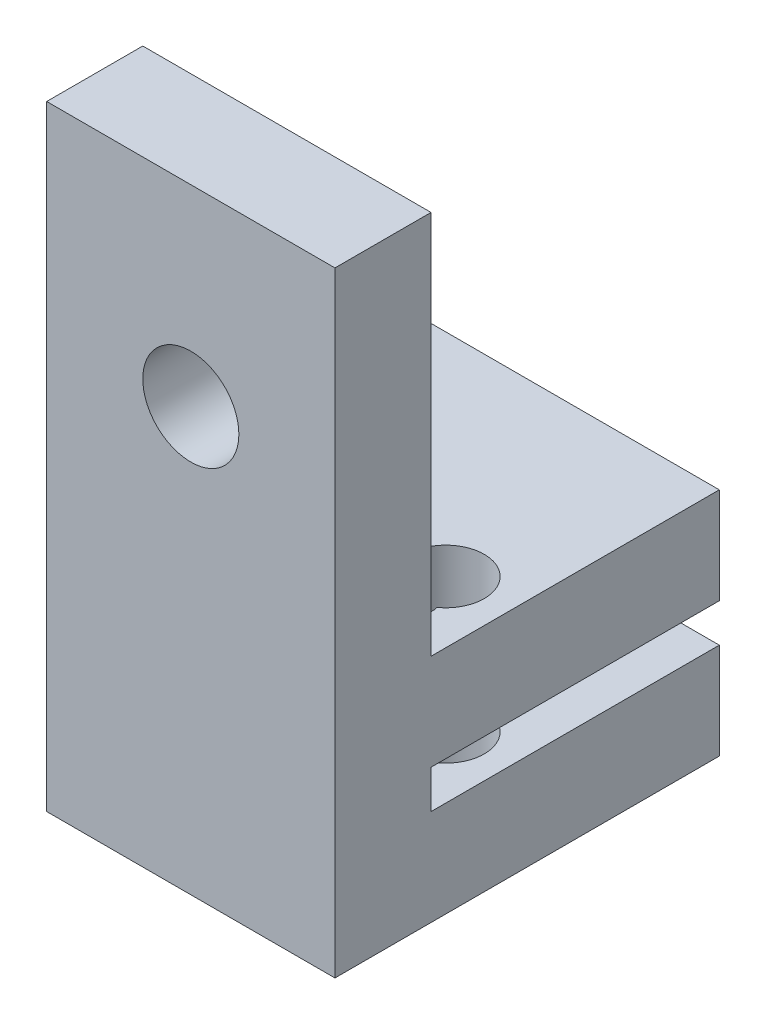
ISO-10303-21;
HEADER;
FILE_DESCRIPTION(('STEP AP214'),'2;1');
FILE_NAME('part.step','',(''),(''),'','','');
FILE_SCHEMA(('AUTOMOTIVE_DESIGN { 1 0 10303 214 1 1 1 1 }'));
ENDSEC;
DATA;
#1=APPLICATION_CONTEXT('core data for automotive mechanical design processes');
#2=APPLICATION_PROTOCOL_DEFINITION('international standard','automotive_design',2000,#1);
#3=PRODUCT_CONTEXT('',#1,'mechanical');
#4=PRODUCT('Part','Part','',(#3));
#5=PRODUCT_RELATED_PRODUCT_CATEGORY('part','',(#4));
#6=PRODUCT_DEFINITION_FORMATION('','',#4);
#7=PRODUCT_DEFINITION_CONTEXT('part definition',#1,'design');
#8=PRODUCT_DEFINITION('design','',#6,#7);
#9=PRODUCT_DEFINITION_SHAPE('','',#8);
#10=(LENGTH_UNIT() NAMED_UNIT(*) SI_UNIT(.MILLI.,.METRE.));
#11=(NAMED_UNIT(*) PLANE_ANGLE_UNIT() SI_UNIT($,.RADIAN.));
#12=(NAMED_UNIT(*) SI_UNIT($,.STERADIAN.) SOLID_ANGLE_UNIT());
#13=UNCERTAINTY_MEASURE_WITH_UNIT(LENGTH_MEASURE(1.E-05),#10,'distance_accuracy_value','');
#14=(GEOMETRIC_REPRESENTATION_CONTEXT(3) GLOBAL_UNCERTAINTY_ASSIGNED_CONTEXT((#13)) GLOBAL_UNIT_ASSIGNED_CONTEXT((#10,
#11,#12)) REPRESENTATION_CONTEXT('',''));
#15=CARTESIAN_POINT('',(0.,0.,0.));
#16=DIRECTION('',(0.,0.,1.));
#17=DIRECTION('',(1.,0.,0.));
#18=AXIS2_PLACEMENT_3D('',#15,#16,#17);
#19=CARTESIAN_POINT('',(15.,12.,0.));
#20=DIRECTION('',(0.,-1.,0.));
#21=DIRECTION('',(0.,0.,-1.));
#22=AXIS2_PLACEMENT_3D('',#19,#20,#21);
#23=PLANE('',#22);
#24=CARTESIAN_POINT('',(3.2115011604219,12.,11.0216006525548));
#25=DIRECTION('',(0.,-1.,0.));
#26=DIRECTION('',(0.,0.,-1.));
#27=AXIS2_PLACEMENT_3D('',#24,#25,#26);
#28=CIRCLE('',#27,2.);
#29=CARTESIAN_POINT('',(4.79508107290247,12.0000000000001,12.2431875961606));
#30=VERTEX_POINT('',#29);
#31=CARTESIAN_POINT('',(2.04272372503703,12.0000000000001,12.6445483739972));
#32=VERTEX_POINT('',#31);
#33=EDGE_CURVE('E178',#30,#32,#28,.F.);
#34=ORIENTED_EDGE('',*,*,#33,.F.);
#35=CARTESIAN_POINT('',(3.5,12.0000000000001,13.0000000000031));
#36=DIRECTION('',(0.,-1.,0.));
#37=DIRECTION('',(0.,0.,-1.));
#38=AXIS2_PLACEMENT_3D('',#35,#36,#37);
#39=CIRCLE('',#38,1.50000000000006);
#40=EDGE_CURVE('E56',#32,#30,#39,.F.);
#41=ORIENTED_EDGE('',*,*,#40,.F.);
#42=EDGE_LOOP('',(#34,#41));
#43=FACE_BOUND('',#42,.T.);
#44=CARTESIAN_POINT('',(11.7884988395781,12.,11.0216006525548));
#45=DIRECTION('',(0.,-1.,0.));
#46=DIRECTION('',(0.,0.,-1.));
#47=AXIS2_PLACEMENT_3D('',#44,#45,#46);
#48=CIRCLE('',#47,2.);
#49=CARTESIAN_POINT('',(12.957276274963,12.0000000000001,12.6445483739972));
#50=VERTEX_POINT('',#49);
#51=CARTESIAN_POINT('',(10.2049189270975,12.,12.2431875961606));
#52=VERTEX_POINT('',#51);
#53=EDGE_CURVE('E179',#50,#52,#48,.F.);
#54=ORIENTED_EDGE('',*,*,#53,.F.);
#55=CARTESIAN_POINT('',(11.5,12.0000000000001,13.0000000000031));
#56=DIRECTION('',(0.,-1.,0.));
#57=DIRECTION('',(0.,0.,-1.));
#58=AXIS2_PLACEMENT_3D('',#55,#56,#57);
#59=CIRCLE('',#58,1.50000000000006);
#60=EDGE_CURVE('E48',#52,#50,#59,.F.);
#61=ORIENTED_EDGE('',*,*,#60,.F.);
#62=EDGE_LOOP('',(#54,#61));
#63=FACE_BOUND('',#62,.T.);
#64=DIRECTION('',(-1.,0.,0.));
#65=VECTOR('',#64,1.);
#66=CARTESIAN_POINT('',(15.,12.0000000000001,15.0000000000112));
#67=LINE('',#66,#65);
#68=CARTESIAN_POINT('',(15.,12.0000000000001,15.0000000000112));
#69=VERTEX_POINT('',#68);
#70=CARTESIAN_POINT('',(0.,12.0000000000001,15.0000000000112));
#71=VERTEX_POINT('',#70);
#72=EDGE_CURVE('E200',#69,#71,#67,.T.);
#73=ORIENTED_EDGE('',*,*,#72,.F.);
#74=DIRECTION('',(0.,0.,1.));
#75=VECTOR('',#74,1.);
#76=CARTESIAN_POINT('',(15.,12.,0.));
#77=LINE('',#76,#75);
#78=CARTESIAN_POINT('',(15.,12.,0.));
#79=VERTEX_POINT('',#78);
#80=EDGE_CURVE('E241',#79,#69,#77,.T.);
#81=ORIENTED_EDGE('',*,*,#80,.F.);
#82=DIRECTION('',(-1.,0.,0.));
#83=VECTOR('',#82,1.);
#84=CARTESIAN_POINT('',(15.,12.,0.));
#85=LINE('',#84,#83);
#86=CARTESIAN_POINT('',(0.,12.,0.));
#87=VERTEX_POINT('',#86);
#88=EDGE_CURVE('E244',#79,#87,#85,.T.);
#89=ORIENTED_EDGE('',*,*,#88,.T.);
#90=DIRECTION('',(0.,0.,1.));
#91=VECTOR('',#90,1.);
#92=CARTESIAN_POINT('',(0.,12.,0.));
#93=LINE('',#92,#91);
#94=EDGE_CURVE('E229',#87,#71,#93,.T.);
#95=ORIENTED_EDGE('',*,*,#94,.T.);
#96=EDGE_LOOP('',(#73,#81,#89,#95));
#97=FACE_BOUND('',#96,.T.);
#98=ADVANCED_FACE('F33',(#43,#63,#97),#23,.F.);
#99=CARTESIAN_POINT('',(15.,-1.11022302462516E-13,20.0000000000031));
#100=DIRECTION('',(0.,0.,-1.));
#101=DIRECTION('',(-1.,0.,0.));
#102=AXIS2_PLACEMENT_3D('',#99,#100,#101);
#103=PLANE('',#102);
#104=DIRECTION('',(0.,-1.,0.));
#105=VECTOR('',#104,1.);
#106=CARTESIAN_POINT('',(0.,-1.11022302462516E-13,20.0000000000031));
#107=LINE('',#106,#105);
#108=CARTESIAN_POINT('',(0.,32.0000000000001,20.0000000000031));
#109=VERTEX_POINT('',#108);
#110=CARTESIAN_POINT('',(0.,-1.11022302462516E-13,20.0000000000031));
#111=VERTEX_POINT('',#110);
#112=EDGE_CURVE('E224',#109,#111,#107,.T.);
#113=ORIENTED_EDGE('',*,*,#112,.T.);
#114=DIRECTION('',(-1.,0.,0.));
#115=VECTOR('',#114,1.);
#116=CARTESIAN_POINT('',(15.,-1.11022302462516E-13,20.0000000000031));
#117=LINE('',#116,#115);
#118=CARTESIAN_POINT('',(15.,-1.11022302462516E-13,20.0000000000031));
#119=VERTEX_POINT('',#118);
#120=EDGE_CURVE('E169',#119,#111,#117,.T.);
#121=ORIENTED_EDGE('',*,*,#120,.F.);
#122=DIRECTION('',(0.,-1.,0.));
#123=VECTOR('',#122,1.);
#124=CARTESIAN_POINT('',(15.,-1.11022302462516E-13,20.0000000000031));
#125=LINE('',#124,#123);
#126=CARTESIAN_POINT('',(15.,32.0000000000001,20.0000000000031));
#127=VERTEX_POINT('',#126);
#128=EDGE_CURVE('E225',#127,#119,#125,.T.);
#129=ORIENTED_EDGE('',*,*,#128,.F.);
#130=DIRECTION('',(-1.,0.,0.));
#131=VECTOR('',#130,1.);
#132=CARTESIAN_POINT('',(15.,32.0000000000001,20.0000000000031));
#133=LINE('',#132,#131);
#134=EDGE_CURVE('E214',#127,#109,#133,.T.);
#135=ORIENTED_EDGE('',*,*,#134,.T.);
#136=EDGE_LOOP('',(#113,#121,#129,#135));
#137=FACE_BOUND('',#136,.T.);
#138=CARTESIAN_POINT('',(7.5,22.0000000000001,20.0000000000031));
#139=DIRECTION('',(0.,0.,1.));
#140=DIRECTION('',(1.,0.,0.));
#141=AXIS2_PLACEMENT_3D('',#138,#139,#140);
#142=CIRCLE('',#141,2.5);
#143=CARTESIAN_POINT('',(10.,22.0000000000001,20.0000000000031));
#144=VERTEX_POINT('',#143);
#145=EDGE_CURVE('E199',#144,#144,#142,.T.);
#146=ORIENTED_EDGE('',*,*,#145,.F.);
#147=EDGE_LOOP('',(#146));
#148=FACE_BOUND('',#147,.T.);
#149=ADVANCED_FACE('F35',(#137,#148),#103,.F.);
#150=CARTESIAN_POINT('',(15.,0.,0.));
#151=DIRECTION('',(0.,1.,0.));
#152=DIRECTION('',(0.,0.,1.));
#153=AXIS2_PLACEMENT_3D('',#150,#151,#152);
#154=PLANE('',#153);
#155=CARTESIAN_POINT('',(3.2115011604219,0.,11.0216006525548));
#156=DIRECTION('',(0.,-1.,0.));
#157=DIRECTION('',(0.,0.,-1.));
#158=AXIS2_PLACEMENT_3D('',#155,#156,#157);
#159=CIRCLE('',#158,2.);
#160=CARTESIAN_POINT('',(2.04272372503705,0.,12.6445483739972));
#161=VERTEX_POINT('',#160);
#162=CARTESIAN_POINT('',(4.79508107290245,0.,12.2431875961605));
#163=VERTEX_POINT('',#162);
#164=EDGE_CURVE('E175',#161,#163,#159,.T.);
#165=ORIENTED_EDGE('',*,*,#164,.F.);
#166=CARTESIAN_POINT('',(3.5,0.,13.0000000000031));
#167=DIRECTION('',(0.,-1.,0.));
#168=DIRECTION('',(0.,0.,-1.));
#169=AXIS2_PLACEMENT_3D('',#166,#167,#168);
#170=CIRCLE('',#169,1.50000000000006);
#171=EDGE_CURVE('E160',#163,#161,#170,.T.);
#172=ORIENTED_EDGE('',*,*,#171,.F.);
#173=EDGE_LOOP('',(#165,#172));
#174=FACE_BOUND('',#173,.T.);
#175=CARTESIAN_POINT('',(11.7884988395781,0.,11.0216006525548));
#176=DIRECTION('',(0.,-1.,0.));
#177=DIRECTION('',(0.,0.,-1.));
#178=AXIS2_PLACEMENT_3D('',#175,#176,#177);
#179=CIRCLE('',#178,2.);
#180=CARTESIAN_POINT('',(10.2049189270975,0.,12.2431875961605));
#181=VERTEX_POINT('',#180);
#182=CARTESIAN_POINT('',(12.957276274963,0.,12.6445483739972));
#183=VERTEX_POINT('',#182);
#184=EDGE_CURVE('E185',#181,#183,#179,.T.);
#185=ORIENTED_EDGE('',*,*,#184,.F.);
#186=CARTESIAN_POINT('',(11.5,0.,13.0000000000031));
#187=DIRECTION('',(0.,-1.,0.));
#188=DIRECTION('',(0.,0.,-1.));
#189=AXIS2_PLACEMENT_3D('',#186,#187,#188);
#190=CIRCLE('',#189,1.50000000000006);
#191=EDGE_CURVE('E545',#183,#181,#190,.T.);
#192=ORIENTED_EDGE('',*,*,#191,.F.);
#193=EDGE_LOOP('',(#185,#192));
#194=FACE_BOUND('',#193,.T.);
#195=DIRECTION('',(0.,0.,-1.));
#196=VECTOR('',#195,1.);
#197=CARTESIAN_POINT('',(0.,0.,0.));
#198=LINE('',#197,#196);
#199=CARTESIAN_POINT('',(0.,0.,0.));
#200=VERTEX_POINT('',#199);
#201=EDGE_CURVE('E247',#111,#200,#198,.T.);
#202=ORIENTED_EDGE('',*,*,#201,.T.);
#203=DIRECTION('',(-1.,0.,0.));
#204=VECTOR('',#203,1.);
#205=CARTESIAN_POINT('',(15.,0.,0.));
#206=LINE('',#205,#204);
#207=CARTESIAN_POINT('',(15.,0.,0.));
#208=VERTEX_POINT('',#207);
#209=EDGE_CURVE('E274',#208,#200,#206,.T.);
#210=ORIENTED_EDGE('',*,*,#209,.F.);
#211=DIRECTION('',(0.,0.,-1.));
#212=VECTOR('',#211,1.);
#213=CARTESIAN_POINT('',(15.,0.,0.));
#214=LINE('',#213,#212);
#215=EDGE_CURVE('E228',#119,#208,#214,.T.);
#216=ORIENTED_EDGE('',*,*,#215,.F.);
#217=ORIENTED_EDGE('',*,*,#120,.T.);
#218=EDGE_LOOP('',(#202,#210,#216,#217));
#219=FACE_BOUND('',#218,.T.);
#220=ADVANCED_FACE('F173',(#174,#194,#219),#154,.F.);
#221=CARTESIAN_POINT('',(15.,0.,0.));
#222=DIRECTION('',(0.,0.,1.));
#223=DIRECTION('',(1.,0.,0.));
#224=AXIS2_PLACEMENT_3D('',#221,#222,#223);
#225=PLANE('',#224);
#226=DIRECTION('',(0.,1.,0.));
#227=VECTOR('',#226,1.);
#228=CARTESIAN_POINT('',(0.,0.,0.));
#229=LINE('',#228,#227);
#230=CARTESIAN_POINT('',(0.,5.,0.));
#231=VERTEX_POINT('',#230);
#232=EDGE_CURVE('E249',#200,#231,#229,.T.);
#233=ORIENTED_EDGE('',*,*,#232,.T.);
#234=DIRECTION('',(-1.,0.,0.));
#235=VECTOR('',#234,1.);
#236=CARTESIAN_POINT('',(15.,5.,0.));
#237=LINE('',#236,#235);
#238=CARTESIAN_POINT('',(15.,5.,0.));
#239=VERTEX_POINT('',#238);
#240=EDGE_CURVE('E271',#239,#231,#237,.T.);
#241=ORIENTED_EDGE('',*,*,#240,.F.);
#242=DIRECTION('',(0.,1.,0.));
#243=VECTOR('',#242,1.);
#244=CARTESIAN_POINT('',(15.,0.,0.));
#245=LINE('',#244,#243);
#246=EDGE_CURVE('E231',#208,#239,#245,.T.);
#247=ORIENTED_EDGE('',*,*,#246,.F.);
#248=ORIENTED_EDGE('',*,*,#209,.T.);
#249=EDGE_LOOP('',(#233,#241,#247,#248));
#250=FACE_BOUND('',#249,.T.);
#251=ADVANCED_FACE('F354',(#250),#225,.F.);
#252=CARTESIAN_POINT('',(15.,5.,0.));
#253=DIRECTION('',(0.,-1.,0.));
#254=DIRECTION('',(0.,0.,-1.));
#255=AXIS2_PLACEMENT_3D('',#252,#253,#254);
#256=PLANE('',#255);
#257=CARTESIAN_POINT('',(3.2115011604219,4.99999999999996,11.0216006525548));
#258=DIRECTION('',(0.,-1.,0.));
#259=DIRECTION('',(0.,0.,-1.));
#260=AXIS2_PLACEMENT_3D('',#257,#258,#259);
#261=CIRCLE('',#260,2.);
#262=CARTESIAN_POINT('',(2.04272372503704,4.99999999999996,12.6445483739972));
#263=VERTEX_POINT('',#262);
#264=CARTESIAN_POINT('',(4.79508107290247,4.99999999999996,12.2431875961605));
#265=VERTEX_POINT('',#264);
#266=EDGE_CURVE('E197',#263,#265,#261,.T.);
#267=ORIENTED_EDGE('',*,*,#266,.T.);
#268=CARTESIAN_POINT('',(3.5,4.99999999999996,13.0000000000031));
#269=DIRECTION('',(0.,-1.,0.));
#270=DIRECTION('',(0.,0.,-1.));
#271=AXIS2_PLACEMENT_3D('',#268,#269,#270);
#272=CIRCLE('',#271,1.50000000000006);
#273=EDGE_CURVE('E163',#265,#263,#272,.T.);
#274=ORIENTED_EDGE('',*,*,#273,.T.);
#275=EDGE_LOOP('',(#267,#274));
#276=FACE_BOUND('',#275,.T.);
#277=CARTESIAN_POINT('',(11.7884988395781,4.99999999999996,11.0216006525548));
#278=DIRECTION('',(0.,-1.,0.));
#279=DIRECTION('',(0.,0.,-1.));
#280=AXIS2_PLACEMENT_3D('',#277,#278,#279);
#281=CIRCLE('',#280,2.);
#282=CARTESIAN_POINT('',(10.2049189270975,4.99999999999996,12.2431875961605));
#283=VERTEX_POINT('',#282);
#284=CARTESIAN_POINT('',(12.957276274963,4.99999999999996,12.6445483739972));
#285=VERTEX_POINT('',#284);
#286=EDGE_CURVE('E193',#283,#285,#281,.T.);
#287=ORIENTED_EDGE('',*,*,#286,.T.);
#288=CARTESIAN_POINT('',(11.5,4.99999999999996,13.0000000000031));
#289=DIRECTION('',(0.,-1.,0.));
#290=DIRECTION('',(0.,0.,-1.));
#291=AXIS2_PLACEMENT_3D('',#288,#289,#290);
#292=CIRCLE('',#291,1.50000000000006);
#293=EDGE_CURVE('E294',#285,#283,#292,.T.);
#294=ORIENTED_EDGE('',*,*,#293,.T.);
#295=EDGE_LOOP('',(#287,#294));
#296=FACE_BOUND('',#295,.T.);
#297=DIRECTION('',(0.,0.,1.));
#298=VECTOR('',#297,1.);
#299=CARTESIAN_POINT('',(0.,5.,0.));
#300=LINE('',#299,#298);
#301=CARTESIAN_POINT('',(0.,4.99999999999995,14.9999999999864));
#302=VERTEX_POINT('',#301);
#303=EDGE_CURVE('E251',#231,#302,#300,.T.);
#304=ORIENTED_EDGE('',*,*,#303,.T.);
#305=DIRECTION('',(-1.,0.,0.));
#306=VECTOR('',#305,1.);
#307=CARTESIAN_POINT('',(15.,4.99999999999995,14.9999999999864));
#308=LINE('',#307,#306);
#309=CARTESIAN_POINT('',(15.,4.99999999999995,14.9999999999864));
#310=VERTEX_POINT('',#309);
#311=EDGE_CURVE('E268',#310,#302,#308,.T.);
#312=ORIENTED_EDGE('',*,*,#311,.F.);
#313=DIRECTION('',(0.,0.,1.));
#314=VECTOR('',#313,1.);
#315=CARTESIAN_POINT('',(15.,5.,0.));
#316=LINE('',#315,#314);
#317=EDGE_CURVE('E233',#239,#310,#316,.T.);
#318=ORIENTED_EDGE('',*,*,#317,.F.);
#319=ORIENTED_EDGE('',*,*,#240,.T.);
#320=EDGE_LOOP('',(#304,#312,#318,#319));
#321=FACE_BOUND('',#320,.T.);
#322=ADVANCED_FACE('F292',(#276,#296,#321),#256,.F.);
#323=CARTESIAN_POINT('',(15.,4.99999999999995,14.9999999999864));
#324=DIRECTION('',(0.,-3.5527136788006E-12,1.));
#325=DIRECTION('',(0.,-1.,-3.5527136788006E-12));
#326=AXIS2_PLACEMENT_3D('',#323,#324,#325);
#327=PLANE('',#326);
#328=DIRECTION('',(0.,1.,3.5527136788006E-12));
#329=VECTOR('',#328,1.);
#330=CARTESIAN_POINT('',(0.,4.99999999999995,14.9999999999864));
#331=LINE('',#330,#329);
#332=CARTESIAN_POINT('',(0.,6.9999999999999,14.9999999999935));
#333=VERTEX_POINT('',#332);
#334=EDGE_CURVE('E253',#302,#333,#331,.T.);
#335=ORIENTED_EDGE('',*,*,#334,.T.);
#336=DIRECTION('',(-1.,0.,0.));
#337=VECTOR('',#336,1.);
#338=CARTESIAN_POINT('',(15.,6.9999999999999,14.9999999999935));
#339=LINE('',#338,#337);
#340=CARTESIAN_POINT('',(15.,6.9999999999999,14.9999999999935));
#341=VERTEX_POINT('',#340);
#342=EDGE_CURVE('E265',#341,#333,#339,.T.);
#343=ORIENTED_EDGE('',*,*,#342,.F.);
#344=DIRECTION('',(0.,1.,3.5527136788006E-12));
#345=VECTOR('',#344,1.);
#346=CARTESIAN_POINT('',(15.,4.99999999999995,14.9999999999864));
#347=LINE('',#346,#345);
#348=EDGE_CURVE('E235',#310,#341,#347,.T.);
#349=ORIENTED_EDGE('',*,*,#348,.F.);
#350=ORIENTED_EDGE('',*,*,#311,.T.);
#351=EDGE_LOOP('',(#335,#343,#349,#350));
#352=FACE_BOUND('',#351,.T.);
#353=ADVANCED_FACE('F315',(#352),#327,.F.);
#354=CARTESIAN_POINT('',(15.,6.99999999999978,0.));
#355=DIRECTION('',(0.,1.,0.));
#356=DIRECTION('',(0.,0.,1.));
#357=AXIS2_PLACEMENT_3D('',#354,#355,#356);
#358=PLANE('',#357);
#359=CARTESIAN_POINT('',(3.2115011604219,6.99999999999987,11.0216006525548));
#360=DIRECTION('',(0.,1.,0.));
#361=DIRECTION('',(0.,0.,1.));
#362=AXIS2_PLACEMENT_3D('',#359,#360,#361);
#363=CIRCLE('',#362,2.);
#364=CARTESIAN_POINT('',(4.79508107290246,6.99999999999988,12.2431875961606));
#365=VERTEX_POINT('',#364);
#366=CARTESIAN_POINT('',(2.04272372503704,6.99999999999988,12.6445483739972));
#367=VERTEX_POINT('',#366);
#368=EDGE_CURVE('E196',#365,#367,#363,.T.);
#369=ORIENTED_EDGE('',*,*,#368,.T.);
#370=CARTESIAN_POINT('',(3.5,6.99999999999988,13.0000000000031));
#371=DIRECTION('',(0.,1.,0.));
#372=DIRECTION('',(0.,0.,1.));
#373=AXIS2_PLACEMENT_3D('',#370,#371,#372);
#374=CIRCLE('',#373,1.50000000000006);
#375=EDGE_CURVE('E301',#367,#365,#374,.T.);
#376=ORIENTED_EDGE('',*,*,#375,.T.);
#377=EDGE_LOOP('',(#369,#376));
#378=FACE_BOUND('',#377,.T.);
#379=CARTESIAN_POINT('',(11.7884988395781,6.99999999999987,11.0216006525548));
#380=DIRECTION('',(0.,1.,0.));
#381=DIRECTION('',(0.,0.,1.));
#382=AXIS2_PLACEMENT_3D('',#379,#380,#381);
#383=CIRCLE('',#382,2.);
#384=CARTESIAN_POINT('',(12.957276274963,6.99999999999988,12.6445483739972));
#385=VERTEX_POINT('',#384);
#386=CARTESIAN_POINT('',(10.2049189270975,6.99999999999987,12.2431875961605));
#387=VERTEX_POINT('',#386);
#388=EDGE_CURVE('E182',#385,#387,#383,.T.);
#389=ORIENTED_EDGE('',*,*,#388,.T.);
#390=CARTESIAN_POINT('',(11.5,6.99999999999988,13.0000000000031));
#391=DIRECTION('',(0.,1.,0.));
#392=DIRECTION('',(0.,0.,1.));
#393=AXIS2_PLACEMENT_3D('',#390,#391,#392);
#394=CIRCLE('',#393,1.50000000000006);
#395=EDGE_CURVE('E298',#387,#385,#394,.T.);
#396=ORIENTED_EDGE('',*,*,#395,.T.);
#397=EDGE_LOOP('',(#389,#396));
#398=FACE_BOUND('',#397,.T.);
#399=DIRECTION('',(0.,0.,-1.));
#400=VECTOR('',#399,1.);
#401=CARTESIAN_POINT('',(0.,6.99999999999978,0.));
#402=LINE('',#401,#400);
#403=CARTESIAN_POINT('',(0.,6.99999999999978,0.));
#404=VERTEX_POINT('',#403);
#405=EDGE_CURVE('E255',#333,#404,#402,.T.);
#406=ORIENTED_EDGE('',*,*,#405,.T.);
#407=DIRECTION('',(-1.,0.,0.));
#408=VECTOR('',#407,1.);
#409=CARTESIAN_POINT('',(15.,6.99999999999978,0.));
#410=LINE('',#409,#408);
#411=CARTESIAN_POINT('',(15.,6.99999999999978,0.));
#412=VERTEX_POINT('',#411);
#413=EDGE_CURVE('E262',#412,#404,#410,.T.);
#414=ORIENTED_EDGE('',*,*,#413,.F.);
#415=DIRECTION('',(0.,0.,-1.));
#416=VECTOR('',#415,1.);
#417=CARTESIAN_POINT('',(15.,6.99999999999978,0.));
#418=LINE('',#417,#416);
#419=EDGE_CURVE('E237',#341,#412,#418,.T.);
#420=ORIENTED_EDGE('',*,*,#419,.F.);
#421=ORIENTED_EDGE('',*,*,#342,.T.);
#422=EDGE_LOOP('',(#406,#414,#420,#421));
#423=FACE_BOUND('',#422,.T.);
#424=ADVANCED_FACE('F311',(#378,#398,#423),#358,.F.);
#425=CARTESIAN_POINT('',(15.,12.,0.));
#426=DIRECTION('',(0.,0.,1.));
#427=DIRECTION('',(1.,0.,0.));
#428=AXIS2_PLACEMENT_3D('',#425,#426,#427);
#429=PLANE('',#428);
#430=DIRECTION('',(0.,1.,0.));
#431=VECTOR('',#430,1.);
#432=CARTESIAN_POINT('',(0.,12.,0.));
#433=LINE('',#432,#431);
#434=EDGE_CURVE('E257',#404,#87,#433,.T.);
#435=ORIENTED_EDGE('',*,*,#434,.T.);
#436=ORIENTED_EDGE('',*,*,#88,.F.);
#437=DIRECTION('',(0.,1.,0.));
#438=VECTOR('',#437,1.);
#439=CARTESIAN_POINT('',(15.,12.,0.));
#440=LINE('',#439,#438);
#441=EDGE_CURVE('E239',#412,#79,#440,.T.);
#442=ORIENTED_EDGE('',*,*,#441,.F.);
#443=ORIENTED_EDGE('',*,*,#413,.T.);
#444=EDGE_LOOP('',(#435,#436,#442,#443));
#445=FACE_BOUND('',#444,.T.);
#446=ADVANCED_FACE('F314',(#445),#429,.F.);
#447=CARTESIAN_POINT('',(15.,0.,0.));
#448=DIRECTION('',(1.,0.,0.));
#449=DIRECTION('',(0.,0.,-1.));
#450=AXIS2_PLACEMENT_3D('',#447,#448,#449);
#451=PLANE('',#450);
#452=ORIENTED_EDGE('',*,*,#128,.T.);
#453=ORIENTED_EDGE('',*,*,#215,.T.);
#454=ORIENTED_EDGE('',*,*,#246,.T.);
#455=ORIENTED_EDGE('',*,*,#317,.T.);
#456=ORIENTED_EDGE('',*,*,#348,.T.);
#457=ORIENTED_EDGE('',*,*,#419,.T.);
#458=ORIENTED_EDGE('',*,*,#441,.T.);
#459=ORIENTED_EDGE('',*,*,#80,.T.);
#460=DIRECTION('',(0.,-1.,-3.5527136788006E-12));
#461=VECTOR('',#460,1.);
#462=CARTESIAN_POINT('',(15.,31.9999999999113,15.0000000000823));
#463=LINE('',#462,#461);
#464=CARTESIAN_POINT('',(15.,32.0000000000001,15.0000000000823));
#465=VERTEX_POINT('',#464);
#466=EDGE_CURVE('E205',#465,#69,#463,.T.);
#467=ORIENTED_EDGE('',*,*,#466,.F.);
#468=DIRECTION('',(0.,0.,1.));
#469=VECTOR('',#468,1.);
#470=CARTESIAN_POINT('',(15.,32.0000000000001,-9.99999999995324));
#471=LINE('',#470,#469);
#472=EDGE_CURVE('E217',#465,#127,#471,.T.);
#473=ORIENTED_EDGE('',*,*,#472,.T.);
#474=EDGE_LOOP('',(#452,#453,#454,#455,#456,#457,#458,#459,#467,#473));
#475=FACE_BOUND('',#474,.T.);
#476=ADVANCED_FACE('F341',(#475),#451,.T.);
#477=CARTESIAN_POINT('',(0.,0.,0.));
#478=DIRECTION('',(1.,0.,0.));
#479=DIRECTION('',(0.,0.,-1.));
#480=AXIS2_PLACEMENT_3D('',#477,#478,#479);
#481=PLANE('',#480);
#482=ORIENTED_EDGE('',*,*,#112,.F.);
#483=DIRECTION('',(0.,0.,1.));
#484=VECTOR('',#483,1.);
#485=CARTESIAN_POINT('',(0.,32.0000000000001,-9.99999999995324));
#486=LINE('',#485,#484);
#487=CARTESIAN_POINT('',(0.,32.0000000000001,15.0000000000823));
#488=VERTEX_POINT('',#487);
#489=EDGE_CURVE('E209',#488,#109,#486,.T.);
#490=ORIENTED_EDGE('',*,*,#489,.F.);
#491=DIRECTION('',(0.,1.,3.5527136788006E-12));
#492=VECTOR('',#491,1.);
#493=CARTESIAN_POINT('',(0.,31.9999999999113,15.0000000000823));
#494=LINE('',#493,#492);
#495=EDGE_CURVE('E204',#71,#488,#494,.T.);
#496=ORIENTED_EDGE('',*,*,#495,.F.);
#497=ORIENTED_EDGE('',*,*,#94,.F.);
#498=ORIENTED_EDGE('',*,*,#434,.F.);
#499=ORIENTED_EDGE('',*,*,#405,.F.);
#500=ORIENTED_EDGE('',*,*,#334,.F.);
#501=ORIENTED_EDGE('',*,*,#303,.F.);
#502=ORIENTED_EDGE('',*,*,#232,.F.);
#503=ORIENTED_EDGE('',*,*,#201,.F.);
#504=EDGE_LOOP('',(#482,#490,#496,#497,#498,#499,#500,#501,#502,#503));
#505=FACE_BOUND('',#504,.T.);
#506=ADVANCED_FACE('F329',(#505),#481,.F.);
#507=CARTESIAN_POINT('',(15.,32.0000000000001,-9.99999999995324));
#508=DIRECTION('',(0.,1.,0.));
#509=DIRECTION('',(0.,0.,1.));
#510=AXIS2_PLACEMENT_3D('',#507,#508,#509);
#511=PLANE('',#510);
#512=DIRECTION('',(1.,0.,0.));
#513=VECTOR('',#512,1.);
#514=CARTESIAN_POINT('',(15.,32.0000000000001,15.0000000000823));
#515=LINE('',#514,#513);
#516=EDGE_CURVE('E208',#488,#465,#515,.T.);
#517=ORIENTED_EDGE('',*,*,#516,.F.);
#518=ORIENTED_EDGE('',*,*,#489,.T.);
#519=ORIENTED_EDGE('',*,*,#134,.F.);
#520=ORIENTED_EDGE('',*,*,#472,.F.);
#521=EDGE_LOOP('',(#517,#518,#519,#520));
#522=FACE_BOUND('',#521,.T.);
#523=ADVANCED_FACE('F344',(#522),#511,.T.);
#524=CARTESIAN_POINT('',(7.5,22.0000000000001,-9.99999999995324));
#525=DIRECTION('',(0.,0.,1.));
#526=DIRECTION('',(1.,0.,0.));
#527=AXIS2_PLACEMENT_3D('',#524,#525,#526);
#528=CYLINDRICAL_SURFACE('',#527,2.5);
#529=CARTESIAN_POINT('',(7.5,22.0000000000001,15.0000000000468));
#530=DIRECTION('',(0.,-3.5527136788006E-12,1.));
#531=DIRECTION('',(0.,-1.,-3.5527136788006E-12));
#532=AXIS2_PLACEMENT_3D('',#529,#530,#531);
#533=CIRCLE('',#532,2.5);
#534=CARTESIAN_POINT('',(7.5,19.5000000000001,15.0000000000379));
#535=VERTEX_POINT('',#534);
#536=EDGE_CURVE('E203',#535,#535,#533,.F.);
#537=ORIENTED_EDGE('',*,*,#536,.T.);
#538=EDGE_LOOP('',(#537));
#539=FACE_BOUND('',#538,.T.);
#540=ORIENTED_EDGE('',*,*,#145,.T.);
#541=EDGE_LOOP('',(#540));
#542=FACE_BOUND('',#541,.T.);
#543=ADVANCED_FACE('F388',(#539,#542),#528,.F.);
#544=CARTESIAN_POINT('',(15.,4.99999999999995,14.9999999999864));
#545=DIRECTION('',(0.,-3.5527136788006E-12,1.));
#546=DIRECTION('',(0.,-1.,-3.5527136788006E-12));
#547=AXIS2_PLACEMENT_3D('',#544,#545,#546);
#548=PLANE('',#547);
#549=ORIENTED_EDGE('',*,*,#495,.T.);
#550=ORIENTED_EDGE('',*,*,#516,.T.);
#551=ORIENTED_EDGE('',*,*,#466,.T.);
#552=ORIENTED_EDGE('',*,*,#72,.T.);
#553=EDGE_LOOP('',(#549,#550,#551,#552));
#554=FACE_BOUND('',#553,.T.);
#555=ORIENTED_EDGE('',*,*,#536,.F.);
#556=EDGE_LOOP('',(#555));
#557=FACE_BOUND('',#556,.T.);
#558=ADVANCED_FACE('F335',(#554,#557),#548,.F.);
#559=CARTESIAN_POINT('',(11.7884988395781,17.6568542494924,11.0216006525549));
#560=DIRECTION('',(0.,-1.,0.));
#561=DIRECTION('',(0.,0.,-1.));
#562=AXIS2_PLACEMENT_3D('',#559,#560,#561);
#563=CYLINDRICAL_SURFACE('',#562,2.);
#564=ORIENTED_EDGE('',*,*,#53,.T.);
#565=DIRECTION('',(0.,-1.,0.));
#566=VECTOR('',#565,1.);
#567=CARTESIAN_POINT('',(10.2049189270975,6.00000000000003,12.2431875961605));
#568=LINE('',#567,#566);
#569=EDGE_CURVE('E188',#52,#387,#568,.T.);
#570=ORIENTED_EDGE('',*,*,#569,.T.);
#571=ORIENTED_EDGE('',*,*,#388,.F.);
#572=DIRECTION('',(0.,-1.,0.));
#573=VECTOR('',#572,1.);
#574=CARTESIAN_POINT('',(12.957276274963,6.00000000000003,12.6445483739972));
#575=LINE('',#574,#573);
#576=EDGE_CURVE('E295',#385,#50,#575,.F.);
#577=ORIENTED_EDGE('',*,*,#576,.T.);
#578=EDGE_LOOP('',(#564,#570,#571,#577));
#579=FACE_BOUND('',#578,.T.);
#580=ADVANCED_FACE('F309',(#579),#563,.F.);
#581=CARTESIAN_POINT('',(3.2115011604219,17.6568542494924,11.0216006525549));
#582=DIRECTION('',(0.,-1.,0.));
#583=DIRECTION('',(0.,0.,-1.));
#584=AXIS2_PLACEMENT_3D('',#581,#582,#583);
#585=CYLINDRICAL_SURFACE('',#584,2.);
#586=ORIENTED_EDGE('',*,*,#33,.T.);
#587=DIRECTION('',(0.,-1.,0.));
#588=VECTOR('',#587,1.);
#589=CARTESIAN_POINT('',(2.04272372503704,6.00000000000003,12.6445483739972));
#590=LINE('',#589,#588);
#591=EDGE_CURVE('E296',#32,#367,#590,.T.);
#592=ORIENTED_EDGE('',*,*,#591,.T.);
#593=ORIENTED_EDGE('',*,*,#368,.F.);
#594=DIRECTION('',(0.,-1.,0.));
#595=VECTOR('',#594,1.);
#596=CARTESIAN_POINT('',(4.79508107290246,6.00000000000003,12.2431875961606));
#597=LINE('',#596,#595);
#598=EDGE_CURVE('E541',#365,#30,#597,.F.);
#599=ORIENTED_EDGE('',*,*,#598,.T.);
#600=EDGE_LOOP('',(#586,#592,#593,#599));
#601=FACE_BOUND('',#600,.T.);
#602=ADVANCED_FACE('F396',(#601),#585,.F.);
#603=ORIENTED_EDGE('',*,*,#286,.F.);
#604=DIRECTION('',(0.,-1.,0.));
#605=VECTOR('',#604,1.);
#606=CARTESIAN_POINT('',(10.2049189270975,6.00000000000003,12.2431875961605));
#607=LINE('',#606,#605);
#608=EDGE_CURVE('E11',#283,#181,#607,.T.);
#609=ORIENTED_EDGE('',*,*,#608,.T.);
#610=ORIENTED_EDGE('',*,*,#184,.T.);
#611=DIRECTION('',(0.,-1.,0.));
#612=VECTOR('',#611,1.);
#613=CARTESIAN_POINT('',(12.957276274963,6.00000000000003,12.6445483739972));
#614=LINE('',#613,#612);
#615=EDGE_CURVE('E41',#183,#285,#614,.F.);
#616=ORIENTED_EDGE('',*,*,#615,.T.);
#617=EDGE_LOOP('',(#603,#609,#610,#616));
#618=FACE_BOUND('',#617,.T.);
#619=ADVANCED_FACE('F286',(#618),#563,.F.);
#620=ORIENTED_EDGE('',*,*,#266,.F.);
#621=DIRECTION('',(0.,-1.,0.));
#622=VECTOR('',#621,1.);
#623=CARTESIAN_POINT('',(2.04272372503704,6.00000000000003,12.6445483739972));
#624=LINE('',#623,#622);
#625=EDGE_CURVE('E168',#263,#161,#624,.T.);
#626=ORIENTED_EDGE('',*,*,#625,.T.);
#627=ORIENTED_EDGE('',*,*,#164,.T.);
#628=DIRECTION('',(0.,-1.,0.));
#629=VECTOR('',#628,1.);
#630=CARTESIAN_POINT('',(4.79508107290246,6.00000000000003,12.2431875961606));
#631=LINE('',#630,#629);
#632=EDGE_CURVE('E157',#163,#265,#631,.F.);
#633=ORIENTED_EDGE('',*,*,#632,.T.);
#634=EDGE_LOOP('',(#620,#626,#627,#633));
#635=FACE_BOUND('',#634,.T.);
#636=ADVANCED_FACE('F177',(#635),#585,.F.);
#637=CARTESIAN_POINT('',(3.5,16.2426406871195,13.0000000000031));
#638=DIRECTION('',(0.,-1.,0.));
#639=DIRECTION('',(0.,0.,-1.));
#640=AXIS2_PLACEMENT_3D('',#637,#638,#639);
#641=CYLINDRICAL_SURFACE('',#640,1.50000000000006);
#642=ORIENTED_EDGE('',*,*,#273,.F.);
#643=ORIENTED_EDGE('',*,*,#632,.F.);
#644=ORIENTED_EDGE('',*,*,#171,.T.);
#645=ORIENTED_EDGE('',*,*,#625,.F.);
#646=EDGE_LOOP('',(#642,#643,#644,#645));
#647=FACE_BOUND('',#646,.T.);
#648=ADVANCED_FACE('F159',(#647),#641,.F.);
#649=CARTESIAN_POINT('',(11.5,16.2426406871195,13.0000000000031));
#650=DIRECTION('',(0.,-1.,0.));
#651=DIRECTION('',(0.,0.,-1.));
#652=AXIS2_PLACEMENT_3D('',#649,#650,#651);
#653=CYLINDRICAL_SURFACE('',#652,1.50000000000006);
#654=ORIENTED_EDGE('',*,*,#293,.F.);
#655=ORIENTED_EDGE('',*,*,#615,.F.);
#656=ORIENTED_EDGE('',*,*,#191,.T.);
#657=ORIENTED_EDGE('',*,*,#608,.F.);
#658=EDGE_LOOP('',(#654,#655,#656,#657));
#659=FACE_BOUND('',#658,.T.);
#660=ADVANCED_FACE('F403',(#659),#653,.F.);
#661=ORIENTED_EDGE('',*,*,#40,.T.);
#662=ORIENTED_EDGE('',*,*,#598,.F.);
#663=ORIENTED_EDGE('',*,*,#375,.F.);
#664=ORIENTED_EDGE('',*,*,#591,.F.);
#665=EDGE_LOOP('',(#661,#662,#663,#664));
#666=FACE_BOUND('',#665,.T.);
#667=ADVANCED_FACE('F402',(#666),#641,.F.);
#668=ORIENTED_EDGE('',*,*,#60,.T.);
#669=ORIENTED_EDGE('',*,*,#576,.F.);
#670=ORIENTED_EDGE('',*,*,#395,.F.);
#671=ORIENTED_EDGE('',*,*,#569,.F.);
#672=EDGE_LOOP('',(#668,#669,#670,#671));
#673=FACE_BOUND('',#672,.T.);
#674=ADVANCED_FACE('F399',(#673),#653,.F.);
#675=CLOSED_SHELL('',(#98,#149,#220,#251,#322,#353,#424,#446,#476,#506,#523,#543,#558,#580,#602,
#619,#636,#648,#660,#667,#674));
#676=MANIFOLD_SOLID_BREP('B2',#675);
#677=ADVANCED_BREP_SHAPE_REPRESENTATION('',(#18,#676),#14);
#678=SHAPE_DEFINITION_REPRESENTATION(#9,#677);
ENDSEC;
END-ISO-10303-21;
